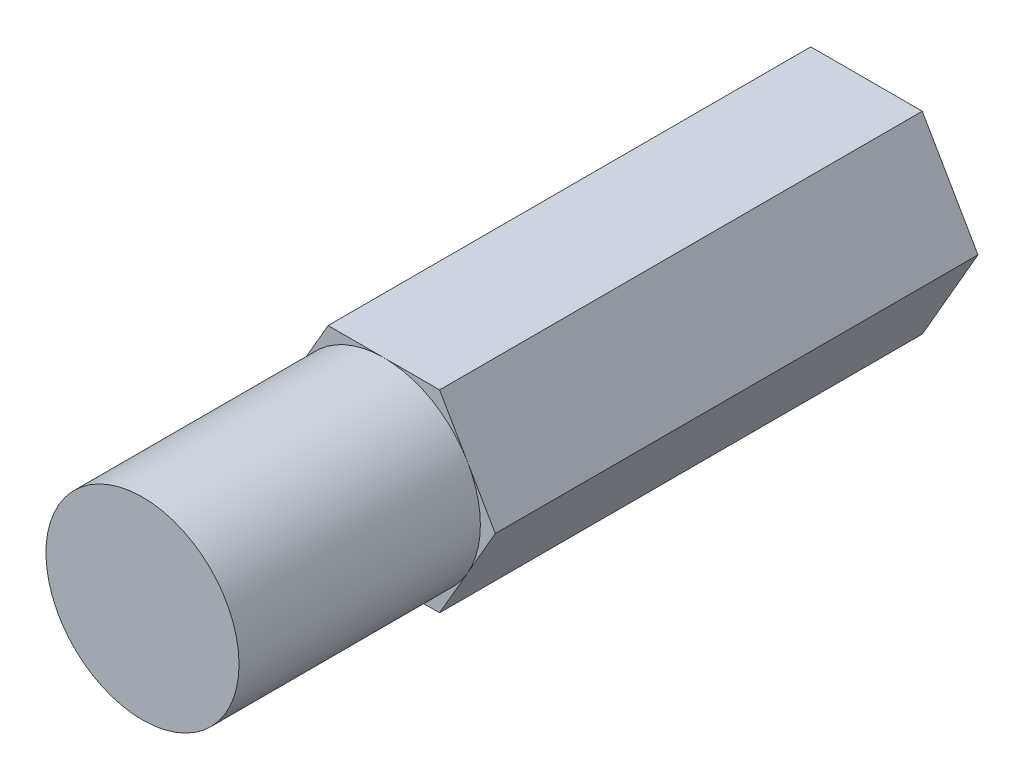
ISO-10303-21;
HEADER;
FILE_DESCRIPTION(('STEP AP214'),'2;1');
FILE_NAME('part.step','',(''),(''),'','','');
FILE_SCHEMA(('AUTOMOTIVE_DESIGN { 1 0 10303 214 1 1 1 1 }'));
ENDSEC;
DATA;
#1=APPLICATION_CONTEXT('core data for automotive mechanical design processes');
#2=APPLICATION_PROTOCOL_DEFINITION('international standard','automotive_design',2000,#1);
#3=PRODUCT_CONTEXT('',#1,'mechanical');
#4=PRODUCT('Part','Part','',(#3));
#5=PRODUCT_RELATED_PRODUCT_CATEGORY('part','',(#4));
#6=PRODUCT_DEFINITION_FORMATION('','',#4);
#7=PRODUCT_DEFINITION_CONTEXT('part definition',#1,'design');
#8=PRODUCT_DEFINITION('design','',#6,#7);
#9=PRODUCT_DEFINITION_SHAPE('','',#8);
#10=(LENGTH_UNIT() NAMED_UNIT(*) SI_UNIT(.MILLI.,.METRE.));
#11=(NAMED_UNIT(*) PLANE_ANGLE_UNIT() SI_UNIT($,.RADIAN.));
#12=(NAMED_UNIT(*) SI_UNIT($,.STERADIAN.) SOLID_ANGLE_UNIT());
#13=UNCERTAINTY_MEASURE_WITH_UNIT(LENGTH_MEASURE(1.E-05),#10,'distance_accuracy_value','');
#14=(GEOMETRIC_REPRESENTATION_CONTEXT(3) GLOBAL_UNCERTAINTY_ASSIGNED_CONTEXT((#13)) GLOBAL_UNIT_ASSIGNED_CONTEXT((#10,
#11,#12)) REPRESENTATION_CONTEXT('',''));
#15=CARTESIAN_POINT('',(0.,0.,0.));
#16=DIRECTION('',(0.,0.,1.));
#17=DIRECTION('',(1.,0.,0.));
#18=AXIS2_PLACEMENT_3D('',#15,#16,#17);
#19=CARTESIAN_POINT('',(0.,0.,10.));
#20=DIRECTION('',(0.,0.,1.));
#21=DIRECTION('',(1.,0.,0.));
#22=AXIS2_PLACEMENT_3D('',#19,#20,#21);
#23=PLANE('',#22);
#24=CARTESIAN_POINT('',(0.,0.,10.));
#25=DIRECTION('',(0.,0.,1.));
#26=DIRECTION('',(1.,0.,0.));
#27=AXIS2_PLACEMENT_3D('',#24,#25,#26);
#28=CIRCLE('',#27,2.);
#29=CARTESIAN_POINT('',(1.73205080756888,1.,10.));
#30=VERTEX_POINT('',#29);
#31=CARTESIAN_POINT('',(0.,2.,10.));
#32=VERTEX_POINT('',#31);
#33=EDGE_CURVE('E48',#30,#32,#28,.T.);
#34=ORIENTED_EDGE('',*,*,#33,.F.);
#35=DIRECTION('',(-0.5,0.866025403784439,0.));
#36=VECTOR('',#35,1.);
#37=CARTESIAN_POINT('',(2.3094010767585,0.,10.));
#38=LINE('',#37,#36);
#39=CARTESIAN_POINT('',(1.15470053837925,2.,10.));
#40=VERTEX_POINT('',#39);
#41=EDGE_CURVE('E120',#30,#40,#38,.T.);
#42=ORIENTED_EDGE('',*,*,#41,.T.);
#43=DIRECTION('',(-1.,0.,0.));
#44=VECTOR('',#43,1.);
#45=CARTESIAN_POINT('',(1.15470053837925,2.,10.));
#46=LINE('',#45,#44);
#47=EDGE_CURVE('E132',#40,#32,#46,.T.);
#48=ORIENTED_EDGE('',*,*,#47,.T.);
#49=EDGE_LOOP('',(#34,#42,#48));
#50=FACE_BOUND('',#49,.T.);
#51=ADVANCED_FACE('F37',(#50),#23,.T.);
#52=CARTESIAN_POINT('',(-1.73205080756888,1.,10.));
#53=VERTEX_POINT('',#52);
#54=EDGE_CURVE('E11',#32,#53,#28,.T.);
#55=ORIENTED_EDGE('',*,*,#54,.F.);
#56=CARTESIAN_POINT('',(-1.15470053837925,2.,10.));
#57=VERTEX_POINT('',#56);
#58=EDGE_CURVE('E119',#32,#57,#46,.T.);
#59=ORIENTED_EDGE('',*,*,#58,.T.);
#60=DIRECTION('',(-0.5,-0.866025403784438,0.));
#61=VECTOR('',#60,1.);
#62=CARTESIAN_POINT('',(-1.15470053837925,2.,10.));
#63=LINE('',#62,#61);
#64=EDGE_CURVE('E155',#57,#53,#63,.T.);
#65=ORIENTED_EDGE('',*,*,#64,.T.);
#66=EDGE_LOOP('',(#55,#59,#65));
#67=FACE_BOUND('',#66,.T.);
#68=ADVANCED_FACE('F196',(#67),#23,.T.);
#69=CARTESIAN_POINT('',(-1.73205080756888,-1.,10.));
#70=VERTEX_POINT('',#69);
#71=EDGE_CURVE('E46',#53,#70,#28,.T.);
#72=ORIENTED_EDGE('',*,*,#71,.F.);
#73=CARTESIAN_POINT('',(-2.3094010767585,0.,10.));
#74=VERTEX_POINT('',#73);
#75=EDGE_CURVE('E154',#53,#74,#63,.T.);
#76=ORIENTED_EDGE('',*,*,#75,.T.);
#77=DIRECTION('',(0.5,-0.866025403784439,0.));
#78=VECTOR('',#77,1.);
#79=CARTESIAN_POINT('',(-2.3094010767585,0.,10.));
#80=LINE('',#79,#78);
#81=EDGE_CURVE('E144',#74,#70,#80,.T.);
#82=ORIENTED_EDGE('',*,*,#81,.T.);
#83=EDGE_LOOP('',(#72,#76,#82));
#84=FACE_BOUND('',#83,.T.);
#85=ADVANCED_FACE('F205',(#84),#23,.T.);
#86=CARTESIAN_POINT('',(0.,-2.,10.));
#87=VERTEX_POINT('',#86);
#88=EDGE_CURVE('E139',#70,#87,#28,.T.);
#89=ORIENTED_EDGE('',*,*,#88,.F.);
#90=CARTESIAN_POINT('',(-1.15470053837925,-2.,10.));
#91=VERTEX_POINT('',#90);
#92=EDGE_CURVE('E147',#70,#91,#80,.T.);
#93=ORIENTED_EDGE('',*,*,#92,.T.);
#94=DIRECTION('',(1.,0.,0.));
#95=VECTOR('',#94,1.);
#96=CARTESIAN_POINT('',(-1.15470053837925,-2.,10.));
#97=LINE('',#96,#95);
#98=EDGE_CURVE('E148',#91,#87,#97,.T.);
#99=ORIENTED_EDGE('',*,*,#98,.T.);
#100=EDGE_LOOP('',(#89,#93,#99));
#101=FACE_BOUND('',#100,.T.);
#102=ADVANCED_FACE('F200',(#101),#23,.T.);
#103=CARTESIAN_POINT('',(1.73205080756888,-1.,10.));
#104=VERTEX_POINT('',#103);
#105=EDGE_CURVE('E138',#87,#104,#28,.T.);
#106=ORIENTED_EDGE('',*,*,#105,.F.);
#107=CARTESIAN_POINT('',(1.15470053837925,-2.,10.));
#108=VERTEX_POINT('',#107);
#109=EDGE_CURVE('E146',#87,#108,#97,.T.);
#110=ORIENTED_EDGE('',*,*,#109,.T.);
#111=DIRECTION('',(0.5,0.866025403784439,0.));
#112=VECTOR('',#111,1.);
#113=CARTESIAN_POINT('',(1.15470053837925,-2.,10.));
#114=LINE('',#113,#112);
#115=EDGE_CURVE('E130',#108,#104,#114,.T.);
#116=ORIENTED_EDGE('',*,*,#115,.T.);
#117=EDGE_LOOP('',(#106,#110,#116));
#118=FACE_BOUND('',#117,.T.);
#119=ADVANCED_FACE('F215',(#118),#23,.T.);
#120=CARTESIAN_POINT('',(-2.3094010767585,0.,10.));
#121=DIRECTION('',(0.866025403784439,0.5,0.));
#122=DIRECTION('',(-0.5,0.866025403784439,0.));
#123=AXIS2_PLACEMENT_3D('',#120,#121,#122);
#124=PLANE('',#123);
#125=DIRECTION('',(0.5,-0.866025403784439,0.));
#126=VECTOR('',#125,1.);
#127=CARTESIAN_POINT('',(-2.3094010767585,0.,0.));
#128=LINE('',#127,#126);
#129=CARTESIAN_POINT('',(-2.3094010767585,0.,0.));
#130=VERTEX_POINT('',#129);
#131=CARTESIAN_POINT('',(-1.15470053837925,-2.,0.));
#132=VERTEX_POINT('',#131);
#133=EDGE_CURVE('E158',#130,#132,#128,.T.);
#134=ORIENTED_EDGE('',*,*,#133,.T.);
#135=DIRECTION('',(0.,0.,-1.));
#136=VECTOR('',#135,1.);
#137=CARTESIAN_POINT('',(-1.15470053837925,-2.,10.));
#138=LINE('',#137,#136);
#139=EDGE_CURVE('E41',#91,#132,#138,.T.);
#140=ORIENTED_EDGE('',*,*,#139,.F.);
#141=ORIENTED_EDGE('',*,*,#92,.F.);
#142=ORIENTED_EDGE('',*,*,#81,.F.);
#143=DIRECTION('',(0.,0.,-1.));
#144=VECTOR('',#143,1.);
#145=CARTESIAN_POINT('',(-2.3094010767585,0.,10.));
#146=LINE('',#145,#144);
#147=EDGE_CURVE('E157',#74,#130,#146,.T.);
#148=ORIENTED_EDGE('',*,*,#147,.T.);
#149=EDGE_LOOP('',(#134,#140,#141,#142,#148));
#150=FACE_BOUND('',#149,.T.);
#151=ADVANCED_FACE('F39',(#150),#124,.F.);
#152=CARTESIAN_POINT('',(-1.15470053837925,-2.,10.));
#153=DIRECTION('',(0.,1.,0.));
#154=DIRECTION('',(-1.,0.,0.));
#155=AXIS2_PLACEMENT_3D('',#152,#153,#154);
#156=PLANE('',#155);
#157=DIRECTION('',(1.,0.,0.));
#158=VECTOR('',#157,1.);
#159=CARTESIAN_POINT('',(-1.15470053837925,-2.,0.));
#160=LINE('',#159,#158);
#161=CARTESIAN_POINT('',(1.15470053837925,-2.,0.));
#162=VERTEX_POINT('',#161);
#163=EDGE_CURVE('E161',#132,#162,#160,.T.);
#164=ORIENTED_EDGE('',*,*,#163,.T.);
#165=DIRECTION('',(0.,0.,-1.));
#166=VECTOR('',#165,1.);
#167=CARTESIAN_POINT('',(1.15470053837925,-2.,10.));
#168=LINE('',#167,#166);
#169=EDGE_CURVE('E141',#108,#162,#168,.T.);
#170=ORIENTED_EDGE('',*,*,#169,.F.);
#171=ORIENTED_EDGE('',*,*,#109,.F.);
#172=ORIENTED_EDGE('',*,*,#98,.F.);
#173=ORIENTED_EDGE('',*,*,#139,.T.);
#174=EDGE_LOOP('',(#164,#170,#171,#172,#173));
#175=FACE_BOUND('',#174,.T.);
#176=ADVANCED_FACE('F285',(#175),#156,.F.);
#177=CARTESIAN_POINT('',(1.15470053837925,-2.,10.));
#178=DIRECTION('',(-0.866025403784439,0.5,0.));
#179=DIRECTION('',(-0.5,-0.866025403784439,0.));
#180=AXIS2_PLACEMENT_3D('',#177,#178,#179);
#181=PLANE('',#180);
#182=DIRECTION('',(0.5,0.866025403784439,0.));
#183=VECTOR('',#182,1.);
#184=CARTESIAN_POINT('',(1.15470053837925,-2.,0.));
#185=LINE('',#184,#183);
#186=CARTESIAN_POINT('',(2.3094010767585,0.,0.));
#187=VERTEX_POINT('',#186);
#188=EDGE_CURVE('E163',#162,#187,#185,.T.);
#189=ORIENTED_EDGE('',*,*,#188,.T.);
#190=DIRECTION('',(0.,0.,-1.));
#191=VECTOR('',#190,1.);
#192=CARTESIAN_POINT('',(2.3094010767585,0.,10.));
#193=LINE('',#192,#191);
#194=CARTESIAN_POINT('',(2.3094010767585,0.,10.));
#195=VERTEX_POINT('',#194);
#196=EDGE_CURVE('E177',#195,#187,#193,.T.);
#197=ORIENTED_EDGE('',*,*,#196,.F.);
#198=EDGE_CURVE('E115',#104,#195,#114,.T.);
#199=ORIENTED_EDGE('',*,*,#198,.F.);
#200=ORIENTED_EDGE('',*,*,#115,.F.);
#201=ORIENTED_EDGE('',*,*,#169,.T.);
#202=EDGE_LOOP('',(#189,#197,#199,#200,#201));
#203=FACE_BOUND('',#202,.T.);
#204=ADVANCED_FACE('F183',(#203),#181,.F.);
#205=CARTESIAN_POINT('',(2.3094010767585,0.,10.));
#206=DIRECTION('',(-0.866025403784439,-0.5,0.));
#207=DIRECTION('',(0.5,-0.866025403784439,0.));
#208=AXIS2_PLACEMENT_3D('',#205,#206,#207);
#209=PLANE('',#208);
#210=DIRECTION('',(-0.5,0.866025403784439,0.));
#211=VECTOR('',#210,1.);
#212=CARTESIAN_POINT('',(2.3094010767585,0.,0.));
#213=LINE('',#212,#211);
#214=CARTESIAN_POINT('',(1.15470053837925,2.,0.));
#215=VERTEX_POINT('',#214);
#216=EDGE_CURVE('E165',#187,#215,#213,.T.);
#217=ORIENTED_EDGE('',*,*,#216,.T.);
#218=DIRECTION('',(0.,0.,-1.));
#219=VECTOR('',#218,1.);
#220=CARTESIAN_POINT('',(1.15470053837925,2.,10.));
#221=LINE('',#220,#219);
#222=EDGE_CURVE('E126',#40,#215,#221,.T.);
#223=ORIENTED_EDGE('',*,*,#222,.F.);
#224=ORIENTED_EDGE('',*,*,#41,.F.);
#225=EDGE_CURVE('E109',#195,#30,#38,.T.);
#226=ORIENTED_EDGE('',*,*,#225,.F.);
#227=ORIENTED_EDGE('',*,*,#196,.T.);
#228=EDGE_LOOP('',(#217,#223,#224,#226,#227));
#229=FACE_BOUND('',#228,.T.);
#230=ADVANCED_FACE('F124',(#229),#209,.F.);
#231=CARTESIAN_POINT('',(1.15470053837925,2.,10.));
#232=DIRECTION('',(0.,-1.,0.));
#233=DIRECTION('',(1.,0.,0.));
#234=AXIS2_PLACEMENT_3D('',#231,#232,#233);
#235=PLANE('',#234);
#236=DIRECTION('',(-1.,0.,0.));
#237=VECTOR('',#236,1.);
#238=CARTESIAN_POINT('',(1.15470053837925,2.,0.));
#239=LINE('',#238,#237);
#240=CARTESIAN_POINT('',(-1.15470053837925,2.,0.));
#241=VERTEX_POINT('',#240);
#242=EDGE_CURVE('E167',#215,#241,#239,.T.);
#243=ORIENTED_EDGE('',*,*,#242,.T.);
#244=DIRECTION('',(0.,0.,-1.));
#245=VECTOR('',#244,1.);
#246=CARTESIAN_POINT('',(-1.15470053837925,2.,10.));
#247=LINE('',#246,#245);
#248=EDGE_CURVE('E173',#57,#241,#247,.T.);
#249=ORIENTED_EDGE('',*,*,#248,.F.);
#250=ORIENTED_EDGE('',*,*,#58,.F.);
#251=ORIENTED_EDGE('',*,*,#47,.F.);
#252=ORIENTED_EDGE('',*,*,#222,.T.);
#253=EDGE_LOOP('',(#243,#249,#250,#251,#252));
#254=FACE_BOUND('',#253,.T.);
#255=ADVANCED_FACE('F193',(#254),#235,.F.);
#256=CARTESIAN_POINT('',(-1.15470053837925,2.,10.));
#257=DIRECTION('',(0.866025403784439,-0.5,0.));
#258=DIRECTION('',(0.5,0.866025403784439,0.));
#259=AXIS2_PLACEMENT_3D('',#256,#257,#258);
#260=PLANE('',#259);
#261=DIRECTION('',(-0.5,-0.866025403784438,0.));
#262=VECTOR('',#261,1.);
#263=CARTESIAN_POINT('',(-1.15470053837925,2.,0.));
#264=LINE('',#263,#262);
#265=EDGE_CURVE('E169',#241,#130,#264,.T.);
#266=ORIENTED_EDGE('',*,*,#265,.T.);
#267=ORIENTED_EDGE('',*,*,#147,.F.);
#268=ORIENTED_EDGE('',*,*,#75,.F.);
#269=ORIENTED_EDGE('',*,*,#64,.F.);
#270=ORIENTED_EDGE('',*,*,#248,.T.);
#271=EDGE_LOOP('',(#266,#267,#268,#269,#270));
#272=FACE_BOUND('',#271,.T.);
#273=ADVANCED_FACE('F207',(#272),#260,.F.);
#274=EDGE_CURVE('E113',#104,#30,#28,.T.);
#275=ORIENTED_EDGE('',*,*,#274,.F.);
#276=ORIENTED_EDGE('',*,*,#198,.T.);
#277=ORIENTED_EDGE('',*,*,#225,.T.);
#278=EDGE_LOOP('',(#275,#276,#277));
#279=FACE_BOUND('',#278,.T.);
#280=ADVANCED_FACE('F111',(#279),#23,.T.);
#281=CARTESIAN_POINT('',(0.,0.,0.));
#282=DIRECTION('',(0.,0.,1.));
#283=DIRECTION('',(1.,0.,0.));
#284=AXIS2_PLACEMENT_3D('',#281,#282,#283);
#285=PLANE('',#284);
#286=ORIENTED_EDGE('',*,*,#133,.F.);
#287=ORIENTED_EDGE('',*,*,#265,.F.);
#288=ORIENTED_EDGE('',*,*,#242,.F.);
#289=ORIENTED_EDGE('',*,*,#216,.F.);
#290=ORIENTED_EDGE('',*,*,#188,.F.);
#291=ORIENTED_EDGE('',*,*,#163,.F.);
#292=EDGE_LOOP('',(#286,#287,#288,#289,#290,#291));
#293=FACE_BOUND('',#292,.T.);
#294=ADVANCED_FACE('F189',(#293),#285,.F.);
#295=CARTESIAN_POINT('',(0.,0.,15.));
#296=DIRECTION('',(0.,0.,-1.));
#297=DIRECTION('',(-1.,0.,0.));
#298=AXIS2_PLACEMENT_3D('',#295,#296,#297);
#299=CYLINDRICAL_SURFACE('',#298,2.);
#300=CARTESIAN_POINT('',(0.,0.,15.));
#301=DIRECTION('',(0.,0.,1.));
#302=DIRECTION('',(1.,0.,0.));
#303=AXIS2_PLACEMENT_3D('',#300,#301,#302);
#304=CIRCLE('',#303,2.);
#305=CARTESIAN_POINT('',(2.,0.,15.));
#306=VERTEX_POINT('',#305);
#307=EDGE_CURVE('E134',#306,#306,#304,.T.);
#308=ORIENTED_EDGE('',*,*,#307,.F.);
#309=EDGE_LOOP('',(#308));
#310=FACE_BOUND('',#309,.T.);
#311=ORIENTED_EDGE('',*,*,#33,.T.);
#312=ORIENTED_EDGE('',*,*,#54,.T.);
#313=ORIENTED_EDGE('',*,*,#71,.T.);
#314=ORIENTED_EDGE('',*,*,#88,.T.);
#315=ORIENTED_EDGE('',*,*,#105,.T.);
#316=ORIENTED_EDGE('',*,*,#274,.T.);
#317=EDGE_LOOP('',(#311,#312,#313,#314,#315,#316));
#318=FACE_BOUND('',#317,.T.);
#319=ADVANCED_FACE('F136',(#310,#318),#299,.T.);
#320=CARTESIAN_POINT('',(0.,0.,15.));
#321=DIRECTION('',(0.,0.,1.));
#322=DIRECTION('',(1.,0.,0.));
#323=AXIS2_PLACEMENT_3D('',#320,#321,#322);
#324=PLANE('',#323);
#325=ORIENTED_EDGE('',*,*,#307,.T.);
#326=EDGE_LOOP('',(#325));
#327=FACE_BOUND('',#326,.T.);
#328=ADVANCED_FACE('F230',(#327),#324,.T.);
#329=CLOSED_SHELL('',(#51,#68,#85,#102,#119,#151,#176,#204,#230,#255,#273,#280,#294,#319,#328));
#330=MANIFOLD_SOLID_BREP('B2',#329);
#331=ADVANCED_BREP_SHAPE_REPRESENTATION('',(#18,#330),#14);
#332=SHAPE_DEFINITION_REPRESENTATION(#9,#331);
ENDSEC;
END-ISO-10303-21;
